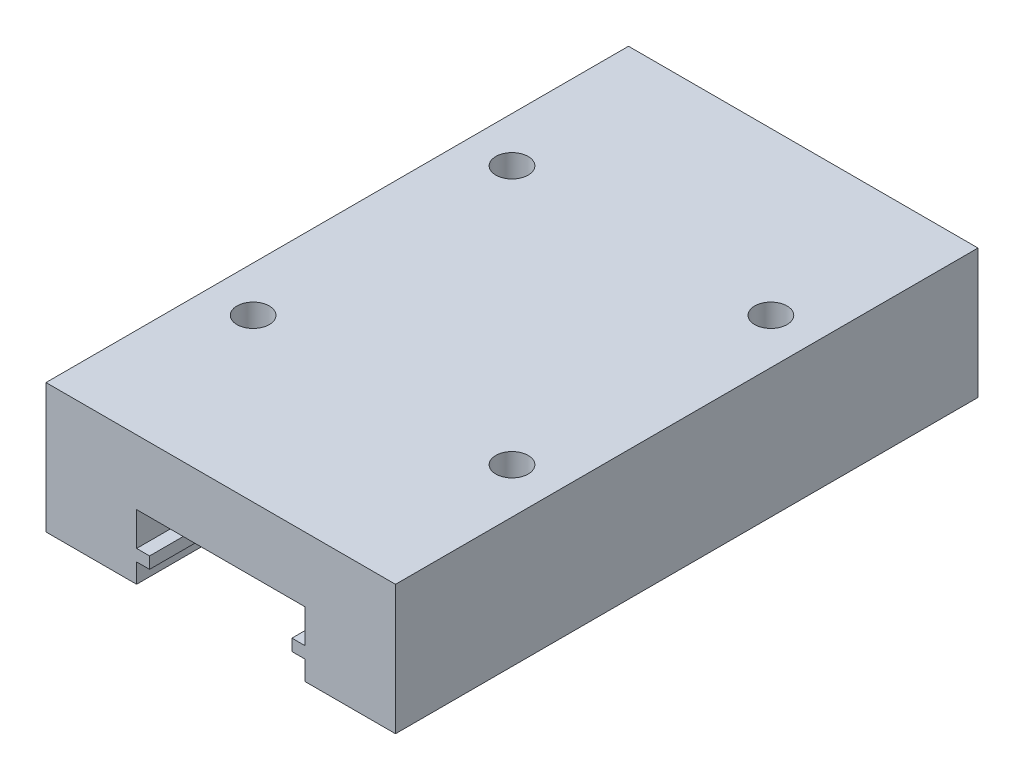
ISO-10303-21;
HEADER;
FILE_DESCRIPTION(('STEP AP214'),'2;1');
FILE_NAME('part.step','',(''),(''),'','','');
FILE_SCHEMA(('AUTOMOTIVE_DESIGN { 1 0 10303 214 1 1 1 1 }'));
ENDSEC;
DATA;
#1=APPLICATION_CONTEXT('core data for automotive mechanical design processes');
#2=APPLICATION_PROTOCOL_DEFINITION('international standard','automotive_design',2000,#1);
#3=PRODUCT_CONTEXT('',#1,'mechanical');
#4=PRODUCT('Part','Part','',(#3));
#5=PRODUCT_RELATED_PRODUCT_CATEGORY('part','',(#4));
#6=PRODUCT_DEFINITION_FORMATION('','',#4);
#7=PRODUCT_DEFINITION_CONTEXT('part definition',#1,'design');
#8=PRODUCT_DEFINITION('design','',#6,#7);
#9=PRODUCT_DEFINITION_SHAPE('','',#8);
#10=(LENGTH_UNIT() NAMED_UNIT(*) SI_UNIT(.MILLI.,.METRE.));
#11=(NAMED_UNIT(*) PLANE_ANGLE_UNIT() SI_UNIT($,.RADIAN.));
#12=(NAMED_UNIT(*) SI_UNIT($,.STERADIAN.) SOLID_ANGLE_UNIT());
#13=UNCERTAINTY_MEASURE_WITH_UNIT(LENGTH_MEASURE(1.E-05),#10,'distance_accuracy_value','');
#14=(GEOMETRIC_REPRESENTATION_CONTEXT(3) GLOBAL_UNCERTAINTY_ASSIGNED_CONTEXT((#13)) GLOBAL_UNIT_ASSIGNED_CONTEXT((#10,
#11,#12)) REPRESENTATION_CONTEXT('',''));
#15=CARTESIAN_POINT('',(0.,0.,0.));
#16=DIRECTION('',(0.,0.,1.));
#17=DIRECTION('',(1.,0.,0.));
#18=AXIS2_PLACEMENT_3D('',#15,#16,#17);
#19=CARTESIAN_POINT('',(13.5,-5.,22.5));
#20=DIRECTION('',(-1.,0.,0.));
#21=DIRECTION('',(0.,0.,1.));
#22=AXIS2_PLACEMENT_3D('',#19,#20,#21);
#23=PLANE('',#22);
#24=DIRECTION('',(0.,1.,0.));
#25=VECTOR('',#24,1.);
#26=CARTESIAN_POINT('',(13.5,-5.,-22.5));
#27=LINE('',#26,#25);
#28=CARTESIAN_POINT('',(13.5,-5.,-22.5));
#29=VERTEX_POINT('',#28);
#30=CARTESIAN_POINT('',(13.5,5.,-22.5));
#31=VERTEX_POINT('',#30);
#32=EDGE_CURVE('E199',#29,#31,#27,.T.);
#33=ORIENTED_EDGE('',*,*,#32,.T.);
#34=DIRECTION('',(0.,0.,-1.));
#35=VECTOR('',#34,1.);
#36=CARTESIAN_POINT('',(13.5,5.,22.5));
#37=LINE('',#36,#35);
#38=CARTESIAN_POINT('',(13.5,5.,22.5));
#39=VERTEX_POINT('',#38);
#40=EDGE_CURVE('E11',#39,#31,#37,.T.);
#41=ORIENTED_EDGE('',*,*,#40,.F.);
#42=DIRECTION('',(0.,1.,0.));
#43=VECTOR('',#42,1.);
#44=CARTESIAN_POINT('',(13.5,-5.,22.5));
#45=LINE('',#44,#43);
#46=CARTESIAN_POINT('',(13.5,-5.,22.5));
#47=VERTEX_POINT('',#46);
#48=EDGE_CURVE('E246',#47,#39,#45,.T.);
#49=ORIENTED_EDGE('',*,*,#48,.F.);
#50=DIRECTION('',(0.,0.,-1.));
#51=VECTOR('',#50,1.);
#52=CARTESIAN_POINT('',(13.5,-5.,22.5));
#53=LINE('',#52,#51);
#54=EDGE_CURVE('E195',#47,#29,#53,.T.);
#55=ORIENTED_EDGE('',*,*,#54,.T.);
#56=EDGE_LOOP('',(#33,#41,#49,#55));
#57=FACE_BOUND('',#56,.T.);
#58=ADVANCED_FACE('F47',(#57),#23,.F.);
#59=CARTESIAN_POINT('',(-13.5,5.,22.5));
#60=DIRECTION('',(0.,-1.,0.));
#61=DIRECTION('',(0.,0.,-1.));
#62=AXIS2_PLACEMENT_3D('',#59,#60,#61);
#63=PLANE('',#62);
#64=CARTESIAN_POINT('',(-10.,5.,-10.));
#65=DIRECTION('',(0.,1.,0.));
#66=DIRECTION('',(0.,0.,1.));
#67=AXIS2_PLACEMENT_3D('',#64,#65,#66);
#68=CIRCLE('',#67,1.25);
#69=CARTESIAN_POINT('',(-10.,5.,-8.75));
#70=VERTEX_POINT('',#69);
#71=EDGE_CURVE('E653',#70,#70,#68,.T.);
#72=ORIENTED_EDGE('',*,*,#71,.F.);
#73=EDGE_LOOP('',(#72));
#74=FACE_BOUND('',#73,.T.);
#75=CARTESIAN_POINT('',(-10.,5.,10.));
#76=DIRECTION('',(0.,1.,0.));
#77=DIRECTION('',(0.,0.,1.));
#78=AXIS2_PLACEMENT_3D('',#75,#76,#77);
#79=CIRCLE('',#78,1.25);
#80=CARTESIAN_POINT('',(-10.,5.,11.25));
#81=VERTEX_POINT('',#80);
#82=EDGE_CURVE('E657',#81,#81,#79,.T.);
#83=ORIENTED_EDGE('',*,*,#82,.F.);
#84=EDGE_LOOP('',(#83));
#85=FACE_BOUND('',#84,.T.);
#86=CARTESIAN_POINT('',(10.,5.,10.));
#87=DIRECTION('',(0.,1.,0.));
#88=DIRECTION('',(0.,0.,1.));
#89=AXIS2_PLACEMENT_3D('',#86,#87,#88);
#90=CIRCLE('',#89,1.25);
#91=CARTESIAN_POINT('',(10.,5.,11.25));
#92=VERTEX_POINT('',#91);
#93=EDGE_CURVE('E667',#92,#92,#90,.T.);
#94=ORIENTED_EDGE('',*,*,#93,.F.);
#95=EDGE_LOOP('',(#94));
#96=FACE_BOUND('',#95,.T.);
#97=CARTESIAN_POINT('',(10.,5.,-10.));
#98=DIRECTION('',(0.,1.,0.));
#99=DIRECTION('',(0.,0.,1.));
#100=AXIS2_PLACEMENT_3D('',#97,#98,#99);
#101=CIRCLE('',#100,1.25);
#102=CARTESIAN_POINT('',(10.,5.,-8.75));
#103=VERTEX_POINT('',#102);
#104=EDGE_CURVE('E675',#103,#103,#101,.T.);
#105=ORIENTED_EDGE('',*,*,#104,.F.);
#106=EDGE_LOOP('',(#105));
#107=FACE_BOUND('',#106,.T.);
#108=DIRECTION('',(-1.,0.,0.));
#109=VECTOR('',#108,1.);
#110=CARTESIAN_POINT('',(-13.5,5.,-22.5));
#111=LINE('',#110,#109);
#112=CARTESIAN_POINT('',(-13.5,5.,-22.5));
#113=VERTEX_POINT('',#112);
#114=EDGE_CURVE('E203',#31,#113,#111,.T.);
#115=ORIENTED_EDGE('',*,*,#114,.T.);
#116=DIRECTION('',(0.,0.,-1.));
#117=VECTOR('',#116,1.);
#118=CARTESIAN_POINT('',(-13.5,5.,22.5));
#119=LINE('',#118,#117);
#120=CARTESIAN_POINT('',(-13.5,5.,22.5));
#121=VERTEX_POINT('',#120);
#122=EDGE_CURVE('E56',#121,#113,#119,.T.);
#123=ORIENTED_EDGE('',*,*,#122,.F.);
#124=DIRECTION('',(-1.,0.,0.));
#125=VECTOR('',#124,1.);
#126=CARTESIAN_POINT('',(-13.5,5.,22.5));
#127=LINE('',#126,#125);
#128=EDGE_CURVE('E132',#39,#121,#127,.T.);
#129=ORIENTED_EDGE('',*,*,#128,.F.);
#130=ORIENTED_EDGE('',*,*,#40,.T.);
#131=EDGE_LOOP('',(#115,#123,#129,#130));
#132=FACE_BOUND('',#131,.T.);
#133=ADVANCED_FACE('F368',(#74,#85,#96,#107,#132),#63,.F.);
#134=CARTESIAN_POINT('',(-13.5,-5.,22.5));
#135=DIRECTION('',(1.,0.,0.));
#136=DIRECTION('',(0.,0.,-1.));
#137=AXIS2_PLACEMENT_3D('',#134,#135,#136);
#138=PLANE('',#137);
#139=DIRECTION('',(0.,-1.,0.));
#140=VECTOR('',#139,1.);
#141=CARTESIAN_POINT('',(-13.5,-5.,-22.5));
#142=LINE('',#141,#140);
#143=CARTESIAN_POINT('',(-13.5,-5.,-22.5));
#144=VERTEX_POINT('',#143);
#145=EDGE_CURVE('E207',#113,#144,#142,.T.);
#146=ORIENTED_EDGE('',*,*,#145,.T.);
#147=DIRECTION('',(0.,0.,-1.));
#148=VECTOR('',#147,1.);
#149=CARTESIAN_POINT('',(-13.5,-5.,22.5));
#150=LINE('',#149,#148);
#151=CARTESIAN_POINT('',(-13.5,-5.,22.5));
#152=VERTEX_POINT('',#151);
#153=EDGE_CURVE('E289',#152,#144,#150,.T.);
#154=ORIENTED_EDGE('',*,*,#153,.F.);
#155=DIRECTION('',(0.,-1.,0.));
#156=VECTOR('',#155,1.);
#157=CARTESIAN_POINT('',(-13.5,-5.,22.5));
#158=LINE('',#157,#156);
#159=EDGE_CURVE('E299',#121,#152,#158,.T.);
#160=ORIENTED_EDGE('',*,*,#159,.F.);
#161=ORIENTED_EDGE('',*,*,#122,.T.);
#162=EDGE_LOOP('',(#146,#154,#160,#161));
#163=FACE_BOUND('',#162,.T.);
#164=ADVANCED_FACE('F297',(#163),#138,.F.);
#165=CARTESIAN_POINT('',(-13.5,-5.,22.5));
#166=DIRECTION('',(0.,1.,0.));
#167=DIRECTION('',(0.,0.,1.));
#168=AXIS2_PLACEMENT_3D('',#165,#166,#167);
#169=PLANE('',#168);
#170=DIRECTION('',(1.,0.,0.));
#171=VECTOR('',#170,1.);
#172=CARTESIAN_POINT('',(-13.5,-5.,-22.5));
#173=LINE('',#172,#171);
#174=CARTESIAN_POINT('',(-6.5,-5.,-22.5));
#175=VERTEX_POINT('',#174);
#176=EDGE_CURVE('E210',#144,#175,#173,.T.);
#177=ORIENTED_EDGE('',*,*,#176,.T.);
#178=DIRECTION('',(0.,0.,-1.));
#179=VECTOR('',#178,1.);
#180=CARTESIAN_POINT('',(-6.5,-5.,22.5));
#181=LINE('',#180,#179);
#182=CARTESIAN_POINT('',(-6.5,-5.,22.5));
#183=VERTEX_POINT('',#182);
#184=EDGE_CURVE('E285',#183,#175,#181,.T.);
#185=ORIENTED_EDGE('',*,*,#184,.F.);
#186=DIRECTION('',(1.,0.,0.));
#187=VECTOR('',#186,1.);
#188=CARTESIAN_POINT('',(-13.5,-5.,22.5));
#189=LINE('',#188,#187);
#190=EDGE_CURVE('E318',#152,#183,#189,.T.);
#191=ORIENTED_EDGE('',*,*,#190,.F.);
#192=ORIENTED_EDGE('',*,*,#153,.T.);
#193=EDGE_LOOP('',(#177,#185,#191,#192));
#194=FACE_BOUND('',#193,.T.);
#195=ADVANCED_FACE('F308',(#194),#169,.F.);
#196=CARTESIAN_POINT('',(-6.5,-5.,22.5));
#197=DIRECTION('',(-1.,0.,0.));
#198=DIRECTION('',(0.,0.,1.));
#199=AXIS2_PLACEMENT_3D('',#196,#197,#198);
#200=PLANE('',#199);
#201=DIRECTION('',(0.,1.,0.));
#202=VECTOR('',#201,1.);
#203=CARTESIAN_POINT('',(-6.5,-5.,-22.5));
#204=LINE('',#203,#202);
#205=CARTESIAN_POINT('',(-6.5,-3.5,-22.5));
#206=VERTEX_POINT('',#205);
#207=EDGE_CURVE('E213',#175,#206,#204,.T.);
#208=ORIENTED_EDGE('',*,*,#207,.T.);
#209=DIRECTION('',(0.,0.,-1.));
#210=VECTOR('',#209,1.);
#211=CARTESIAN_POINT('',(-6.5,-3.5,22.5));
#212=LINE('',#211,#210);
#213=CARTESIAN_POINT('',(-6.5,-3.5,22.5));
#214=VERTEX_POINT('',#213);
#215=EDGE_CURVE('E281',#214,#206,#212,.T.);
#216=ORIENTED_EDGE('',*,*,#215,.F.);
#217=DIRECTION('',(0.,1.,0.));
#218=VECTOR('',#217,1.);
#219=CARTESIAN_POINT('',(-6.5,-5.,22.5));
#220=LINE('',#219,#218);
#221=EDGE_CURVE('E314',#183,#214,#220,.T.);
#222=ORIENTED_EDGE('',*,*,#221,.F.);
#223=ORIENTED_EDGE('',*,*,#184,.T.);
#224=EDGE_LOOP('',(#208,#216,#222,#223));
#225=FACE_BOUND('',#224,.T.);
#226=ADVANCED_FACE('F312',(#225),#200,.F.);
#227=CARTESIAN_POINT('',(-6.5,-3.5,22.5));
#228=DIRECTION('',(0.,1.,0.));
#229=DIRECTION('',(-1.,0.,0.));
#230=AXIS2_PLACEMENT_3D('',#227,#228,#229);
#231=PLANE('',#230);
#232=DIRECTION('',(1.,0.,0.));
#233=VECTOR('',#232,1.);
#234=CARTESIAN_POINT('',(-6.5,-3.5,-22.5));
#235=LINE('',#234,#233);
#236=CARTESIAN_POINT('',(-5.5,-3.5,-22.5));
#237=VERTEX_POINT('',#236);
#238=EDGE_CURVE('E216',#206,#237,#235,.T.);
#239=ORIENTED_EDGE('',*,*,#238,.T.);
#240=DIRECTION('',(0.,0.,-1.));
#241=VECTOR('',#240,1.);
#242=CARTESIAN_POINT('',(-5.5,-3.5,22.5));
#243=LINE('',#242,#241);
#244=CARTESIAN_POINT('',(-5.5,-3.5,22.5));
#245=VERTEX_POINT('',#244);
#246=EDGE_CURVE('E277',#245,#237,#243,.T.);
#247=ORIENTED_EDGE('',*,*,#246,.F.);
#248=DIRECTION('',(1.,0.,0.));
#249=VECTOR('',#248,1.);
#250=CARTESIAN_POINT('',(-6.5,-3.5,22.5));
#251=LINE('',#250,#249);
#252=EDGE_CURVE('E317',#214,#245,#251,.T.);
#253=ORIENTED_EDGE('',*,*,#252,.F.);
#254=ORIENTED_EDGE('',*,*,#215,.T.);
#255=EDGE_LOOP('',(#239,#247,#253,#254));
#256=FACE_BOUND('',#255,.T.);
#257=ADVANCED_FACE('F384',(#256),#231,.F.);
#258=CARTESIAN_POINT('',(-5.5,-2.6,22.5));
#259=DIRECTION('',(-1.,0.,0.));
#260=DIRECTION('',(0.,0.,1.));
#261=AXIS2_PLACEMENT_3D('',#258,#259,#260);
#262=PLANE('',#261);
#263=DIRECTION('',(0.,1.,0.));
#264=VECTOR('',#263,1.);
#265=CARTESIAN_POINT('',(-5.5,-2.6,-22.5));
#266=LINE('',#265,#264);
#267=CARTESIAN_POINT('',(-5.5,-2.6,-22.5));
#268=VERTEX_POINT('',#267);
#269=EDGE_CURVE('E219',#237,#268,#266,.T.);
#270=ORIENTED_EDGE('',*,*,#269,.T.);
#271=DIRECTION('',(0.,0.,-1.));
#272=VECTOR('',#271,1.);
#273=CARTESIAN_POINT('',(-5.5,-2.6,22.5));
#274=LINE('',#273,#272);
#275=CARTESIAN_POINT('',(-5.5,-2.6,22.5));
#276=VERTEX_POINT('',#275);
#277=EDGE_CURVE('E273',#276,#268,#274,.T.);
#278=ORIENTED_EDGE('',*,*,#277,.F.);
#279=DIRECTION('',(0.,1.,0.));
#280=VECTOR('',#279,1.);
#281=CARTESIAN_POINT('',(-5.5,-2.6,22.5));
#282=LINE('',#281,#280);
#283=EDGE_CURVE('E322',#245,#276,#282,.T.);
#284=ORIENTED_EDGE('',*,*,#283,.F.);
#285=ORIENTED_EDGE('',*,*,#246,.T.);
#286=EDGE_LOOP('',(#270,#278,#284,#285));
#287=FACE_BOUND('',#286,.T.);
#288=ADVANCED_FACE('F387',(#287),#262,.F.);
#289=CARTESIAN_POINT('',(-6.5,-2.6,22.5));
#290=DIRECTION('',(0.,-1.,0.));
#291=DIRECTION('',(1.,0.,0.));
#292=AXIS2_PLACEMENT_3D('',#289,#290,#291);
#293=PLANE('',#292);
#294=DIRECTION('',(-1.,0.,0.));
#295=VECTOR('',#294,1.);
#296=CARTESIAN_POINT('',(-6.5,-2.6,-22.5));
#297=LINE('',#296,#295);
#298=CARTESIAN_POINT('',(-6.5,-2.6,-22.5));
#299=VERTEX_POINT('',#298);
#300=EDGE_CURVE('E222',#268,#299,#297,.T.);
#301=ORIENTED_EDGE('',*,*,#300,.T.);
#302=DIRECTION('',(0.,0.,-1.));
#303=VECTOR('',#302,1.);
#304=CARTESIAN_POINT('',(-6.5,-2.6,22.5));
#305=LINE('',#304,#303);
#306=CARTESIAN_POINT('',(-6.5,-2.6,22.5));
#307=VERTEX_POINT('',#306);
#308=EDGE_CURVE('E269',#307,#299,#305,.T.);
#309=ORIENTED_EDGE('',*,*,#308,.F.);
#310=DIRECTION('',(-1.,0.,0.));
#311=VECTOR('',#310,1.);
#312=CARTESIAN_POINT('',(-6.5,-2.6,22.5));
#313=LINE('',#312,#311);
#314=EDGE_CURVE('E329',#276,#307,#313,.T.);
#315=ORIENTED_EDGE('',*,*,#314,.F.);
#316=ORIENTED_EDGE('',*,*,#277,.T.);
#317=EDGE_LOOP('',(#301,#309,#315,#316));
#318=FACE_BOUND('',#317,.T.);
#319=ADVANCED_FACE('F391',(#318),#293,.F.);
#320=CARTESIAN_POINT('',(-6.5,-2.6,22.5));
#321=DIRECTION('',(-1.,0.,0.));
#322=DIRECTION('',(0.,0.,1.));
#323=AXIS2_PLACEMENT_3D('',#320,#321,#322);
#324=PLANE('',#323);
#325=DIRECTION('',(0.,1.,0.));
#326=VECTOR('',#325,1.);
#327=CARTESIAN_POINT('',(-6.5,-2.6,-22.5));
#328=LINE('',#327,#326);
#329=CARTESIAN_POINT('',(-6.5,0.,-22.5));
#330=VERTEX_POINT('',#329);
#331=EDGE_CURVE('E225',#299,#330,#328,.T.);
#332=ORIENTED_EDGE('',*,*,#331,.T.);
#333=DIRECTION('',(0.,0.,-1.));
#334=VECTOR('',#333,1.);
#335=CARTESIAN_POINT('',(-6.5,0.,22.5));
#336=LINE('',#335,#334);
#337=CARTESIAN_POINT('',(-6.5,0.,22.5));
#338=VERTEX_POINT('',#337);
#339=EDGE_CURVE('E265',#338,#330,#336,.T.);
#340=ORIENTED_EDGE('',*,*,#339,.F.);
#341=DIRECTION('',(0.,1.,0.));
#342=VECTOR('',#341,1.);
#343=CARTESIAN_POINT('',(-6.5,-2.6,22.5));
#344=LINE('',#343,#342);
#345=EDGE_CURVE('E332',#307,#338,#344,.T.);
#346=ORIENTED_EDGE('',*,*,#345,.F.);
#347=ORIENTED_EDGE('',*,*,#308,.T.);
#348=EDGE_LOOP('',(#332,#340,#346,#347));
#349=FACE_BOUND('',#348,.T.);
#350=ADVANCED_FACE('F395',(#349),#324,.F.);
#351=CARTESIAN_POINT('',(-6.5,0.,22.5));
#352=DIRECTION('',(0.,1.,0.));
#353=DIRECTION('',(0.,0.,1.));
#354=AXIS2_PLACEMENT_3D('',#351,#352,#353);
#355=PLANE('',#354);
#356=DIRECTION('',(1.,0.,0.));
#357=VECTOR('',#356,1.);
#358=CARTESIAN_POINT('',(-6.5,0.,-22.5));
#359=LINE('',#358,#357);
#360=CARTESIAN_POINT('',(6.5,0.,-22.5));
#361=VERTEX_POINT('',#360);
#362=EDGE_CURVE('E228',#330,#361,#359,.T.);
#363=ORIENTED_EDGE('',*,*,#362,.T.);
#364=DIRECTION('',(0.,0.,-1.));
#365=VECTOR('',#364,1.);
#366=CARTESIAN_POINT('',(6.5,0.,22.5));
#367=LINE('',#366,#365);
#368=CARTESIAN_POINT('',(6.5,0.,22.5));
#369=VERTEX_POINT('',#368);
#370=EDGE_CURVE('E261',#369,#361,#367,.T.);
#371=ORIENTED_EDGE('',*,*,#370,.F.);
#372=DIRECTION('',(1.,0.,0.));
#373=VECTOR('',#372,1.);
#374=CARTESIAN_POINT('',(-6.5,0.,22.5));
#375=LINE('',#374,#373);
#376=EDGE_CURVE('E335',#338,#369,#375,.T.);
#377=ORIENTED_EDGE('',*,*,#376,.F.);
#378=ORIENTED_EDGE('',*,*,#339,.T.);
#379=EDGE_LOOP('',(#363,#371,#377,#378));
#380=FACE_BOUND('',#379,.T.);
#381=ADVANCED_FACE('F399',(#380),#355,.F.);
#382=CARTESIAN_POINT('',(6.5,-2.6,22.5));
#383=DIRECTION('',(1.,0.,0.));
#384=DIRECTION('',(0.,1.,0.));
#385=AXIS2_PLACEMENT_3D('',#382,#383,#384);
#386=PLANE('',#385);
#387=DIRECTION('',(0.,-1.,0.));
#388=VECTOR('',#387,1.);
#389=CARTESIAN_POINT('',(6.5,-2.6,-22.5));
#390=LINE('',#389,#388);
#391=CARTESIAN_POINT('',(6.5,-2.6,-22.5));
#392=VERTEX_POINT('',#391);
#393=EDGE_CURVE('E231',#361,#392,#390,.T.);
#394=ORIENTED_EDGE('',*,*,#393,.T.);
#395=DIRECTION('',(0.,0.,-1.));
#396=VECTOR('',#395,1.);
#397=CARTESIAN_POINT('',(6.5,-2.6,22.5));
#398=LINE('',#397,#396);
#399=CARTESIAN_POINT('',(6.5,-2.6,22.5));
#400=VERTEX_POINT('',#399);
#401=EDGE_CURVE('E257',#400,#392,#398,.T.);
#402=ORIENTED_EDGE('',*,*,#401,.F.);
#403=DIRECTION('',(0.,-1.,0.));
#404=VECTOR('',#403,1.);
#405=CARTESIAN_POINT('',(6.5,-2.6,22.5));
#406=LINE('',#405,#404);
#407=EDGE_CURVE('E338',#369,#400,#406,.T.);
#408=ORIENTED_EDGE('',*,*,#407,.F.);
#409=ORIENTED_EDGE('',*,*,#370,.T.);
#410=EDGE_LOOP('',(#394,#402,#408,#409));
#411=FACE_BOUND('',#410,.T.);
#412=ADVANCED_FACE('F403',(#411),#386,.F.);
#413=CARTESIAN_POINT('',(6.5,-2.6,22.5));
#414=DIRECTION('',(0.,-1.,0.));
#415=DIRECTION('',(1.,0.,0.));
#416=AXIS2_PLACEMENT_3D('',#413,#414,#415);
#417=PLANE('',#416);
#418=DIRECTION('',(-1.,0.,0.));
#419=VECTOR('',#418,1.);
#420=CARTESIAN_POINT('',(6.5,-2.6,-22.5));
#421=LINE('',#420,#419);
#422=CARTESIAN_POINT('',(5.5,-2.6,-22.5));
#423=VERTEX_POINT('',#422);
#424=EDGE_CURVE('E234',#392,#423,#421,.T.);
#425=ORIENTED_EDGE('',*,*,#424,.T.);
#426=DIRECTION('',(0.,0.,-1.));
#427=VECTOR('',#426,1.);
#428=CARTESIAN_POINT('',(5.5,-2.6,22.5));
#429=LINE('',#428,#427);
#430=CARTESIAN_POINT('',(5.5,-2.6,22.5));
#431=VERTEX_POINT('',#430);
#432=EDGE_CURVE('E253',#431,#423,#429,.T.);
#433=ORIENTED_EDGE('',*,*,#432,.F.);
#434=DIRECTION('',(-1.,0.,0.));
#435=VECTOR('',#434,1.);
#436=CARTESIAN_POINT('',(6.5,-2.6,22.5));
#437=LINE('',#436,#435);
#438=EDGE_CURVE('E341',#400,#431,#437,.T.);
#439=ORIENTED_EDGE('',*,*,#438,.F.);
#440=ORIENTED_EDGE('',*,*,#401,.T.);
#441=EDGE_LOOP('',(#425,#433,#439,#440));
#442=FACE_BOUND('',#441,.T.);
#443=ADVANCED_FACE('F349',(#442),#417,.F.);
#444=CARTESIAN_POINT('',(5.5,-2.6,22.5));
#445=DIRECTION('',(1.,0.,0.));
#446=DIRECTION('',(0.,0.,-1.));
#447=AXIS2_PLACEMENT_3D('',#444,#445,#446);
#448=PLANE('',#447);
#449=DIRECTION('',(0.,-1.,0.));
#450=VECTOR('',#449,1.);
#451=CARTESIAN_POINT('',(5.5,-2.6,-22.5));
#452=LINE('',#451,#450);
#453=CARTESIAN_POINT('',(5.5,-3.5,-22.5));
#454=VERTEX_POINT('',#453);
#455=EDGE_CURVE('E237',#423,#454,#452,.T.);
#456=ORIENTED_EDGE('',*,*,#455,.T.);
#457=DIRECTION('',(0.,0.,-1.));
#458=VECTOR('',#457,1.);
#459=CARTESIAN_POINT('',(5.5,-3.5,22.5));
#460=LINE('',#459,#458);
#461=CARTESIAN_POINT('',(5.5,-3.5,22.5));
#462=VERTEX_POINT('',#461);
#463=EDGE_CURVE('E188',#462,#454,#460,.T.);
#464=ORIENTED_EDGE('',*,*,#463,.F.);
#465=DIRECTION('',(0.,-1.,0.));
#466=VECTOR('',#465,1.);
#467=CARTESIAN_POINT('',(5.5,-2.6,22.5));
#468=LINE('',#467,#466);
#469=EDGE_CURVE('E177',#431,#462,#468,.T.);
#470=ORIENTED_EDGE('',*,*,#469,.F.);
#471=ORIENTED_EDGE('',*,*,#432,.T.);
#472=EDGE_LOOP('',(#456,#464,#470,#471));
#473=FACE_BOUND('',#472,.T.);
#474=ADVANCED_FACE('F353',(#473),#448,.F.);
#475=CARTESIAN_POINT('',(6.5,-3.5,22.5));
#476=DIRECTION('',(0.,1.,0.));
#477=DIRECTION('',(-1.,0.,0.));
#478=AXIS2_PLACEMENT_3D('',#475,#476,#477);
#479=PLANE('',#478);
#480=DIRECTION('',(1.,0.,0.));
#481=VECTOR('',#480,1.);
#482=CARTESIAN_POINT('',(6.5,-3.5,-22.5));
#483=LINE('',#482,#481);
#484=CARTESIAN_POINT('',(6.5,-3.5,-22.5));
#485=VERTEX_POINT('',#484);
#486=EDGE_CURVE('E186',#454,#485,#483,.T.);
#487=ORIENTED_EDGE('',*,*,#486,.T.);
#488=DIRECTION('',(0.,0.,-1.));
#489=VECTOR('',#488,1.);
#490=CARTESIAN_POINT('',(6.5,-3.5,22.5));
#491=LINE('',#490,#489);
#492=CARTESIAN_POINT('',(6.5,-3.5,22.5));
#493=VERTEX_POINT('',#492);
#494=EDGE_CURVE('E183',#493,#485,#491,.T.);
#495=ORIENTED_EDGE('',*,*,#494,.F.);
#496=DIRECTION('',(1.,0.,0.));
#497=VECTOR('',#496,1.);
#498=CARTESIAN_POINT('',(6.5,-3.5,22.5));
#499=LINE('',#498,#497);
#500=EDGE_CURVE('E171',#462,#493,#499,.T.);
#501=ORIENTED_EDGE('',*,*,#500,.F.);
#502=ORIENTED_EDGE('',*,*,#463,.T.);
#503=EDGE_LOOP('',(#487,#495,#501,#502));
#504=FACE_BOUND('',#503,.T.);
#505=ADVANCED_FACE('F184',(#504),#479,.F.);
#506=CARTESIAN_POINT('',(6.5,-5.,22.5));
#507=DIRECTION('',(1.,0.,0.));
#508=DIRECTION('',(0.,1.,0.));
#509=AXIS2_PLACEMENT_3D('',#506,#507,#508);
#510=PLANE('',#509);
#511=DIRECTION('',(0.,-1.,0.));
#512=VECTOR('',#511,1.);
#513=CARTESIAN_POINT('',(6.5,-5.,-22.5));
#514=LINE('',#513,#512);
#515=CARTESIAN_POINT('',(6.5,-5.,-22.5));
#516=VERTEX_POINT('',#515);
#517=EDGE_CURVE('E118',#485,#516,#514,.T.);
#518=ORIENTED_EDGE('',*,*,#517,.T.);
#519=DIRECTION('',(0.,0.,-1.));
#520=VECTOR('',#519,1.);
#521=CARTESIAN_POINT('',(6.5,-5.,22.5));
#522=LINE('',#521,#520);
#523=CARTESIAN_POINT('',(6.5,-5.,22.5));
#524=VERTEX_POINT('',#523);
#525=EDGE_CURVE('E189',#524,#516,#522,.T.);
#526=ORIENTED_EDGE('',*,*,#525,.F.);
#527=DIRECTION('',(0.,-1.,0.));
#528=VECTOR('',#527,1.);
#529=CARTESIAN_POINT('',(6.5,-5.,22.5));
#530=LINE('',#529,#528);
#531=EDGE_CURVE('E175',#493,#524,#530,.T.);
#532=ORIENTED_EDGE('',*,*,#531,.F.);
#533=ORIENTED_EDGE('',*,*,#494,.T.);
#534=EDGE_LOOP('',(#518,#526,#532,#533));
#535=FACE_BOUND('',#534,.T.);
#536=ADVANCED_FACE('F191',(#535),#510,.F.);
#537=CARTESIAN_POINT('',(6.5,-5.,22.5));
#538=DIRECTION('',(0.,1.,0.));
#539=DIRECTION('',(-1.,0.,0.));
#540=AXIS2_PLACEMENT_3D('',#537,#538,#539);
#541=PLANE('',#540);
#542=DIRECTION('',(1.,0.,0.));
#543=VECTOR('',#542,1.);
#544=CARTESIAN_POINT('',(6.5,-5.,-22.5));
#545=LINE('',#544,#543);
#546=EDGE_CURVE('E124',#516,#29,#545,.T.);
#547=ORIENTED_EDGE('',*,*,#546,.T.);
#548=ORIENTED_EDGE('',*,*,#54,.F.);
#549=DIRECTION('',(1.,0.,0.));
#550=VECTOR('',#549,1.);
#551=CARTESIAN_POINT('',(6.5,-5.,22.5));
#552=LINE('',#551,#550);
#553=EDGE_CURVE('E64',#524,#47,#552,.T.);
#554=ORIENTED_EDGE('',*,*,#553,.F.);
#555=ORIENTED_EDGE('',*,*,#525,.T.);
#556=EDGE_LOOP('',(#547,#548,#554,#555));
#557=FACE_BOUND('',#556,.T.);
#558=ADVANCED_FACE('F357',(#557),#541,.F.);
#559=CARTESIAN_POINT('',(0.,0.,22.5));
#560=DIRECTION('',(0.,0.,-1.));
#561=DIRECTION('',(-1.,0.,0.));
#562=AXIS2_PLACEMENT_3D('',#559,#560,#561);
#563=PLANE('',#562);
#564=ORIENTED_EDGE('',*,*,#48,.T.);
#565=ORIENTED_EDGE('',*,*,#128,.T.);
#566=ORIENTED_EDGE('',*,*,#159,.T.);
#567=ORIENTED_EDGE('',*,*,#190,.T.);
#568=ORIENTED_EDGE('',*,*,#221,.T.);
#569=ORIENTED_EDGE('',*,*,#252,.T.);
#570=ORIENTED_EDGE('',*,*,#283,.T.);
#571=ORIENTED_EDGE('',*,*,#314,.T.);
#572=ORIENTED_EDGE('',*,*,#345,.T.);
#573=ORIENTED_EDGE('',*,*,#376,.T.);
#574=ORIENTED_EDGE('',*,*,#407,.T.);
#575=ORIENTED_EDGE('',*,*,#438,.T.);
#576=ORIENTED_EDGE('',*,*,#469,.T.);
#577=ORIENTED_EDGE('',*,*,#500,.T.);
#578=ORIENTED_EDGE('',*,*,#531,.T.);
#579=ORIENTED_EDGE('',*,*,#553,.T.);
#580=EDGE_LOOP('',(#564,#565,#566,#567,#568,#569,#570,#571,#572,#573,#574,#575,#576,#577,#578,#579));
#581=FACE_BOUND('',#580,.T.);
#582=ADVANCED_FACE('F173',(#581),#563,.F.);
#583=CARTESIAN_POINT('',(0.,0.,-22.5));
#584=DIRECTION('',(0.,0.,-1.));
#585=DIRECTION('',(-1.,0.,0.));
#586=AXIS2_PLACEMENT_3D('',#583,#584,#585);
#587=PLANE('',#586);
#588=ORIENTED_EDGE('',*,*,#32,.F.);
#589=ORIENTED_EDGE('',*,*,#546,.F.);
#590=ORIENTED_EDGE('',*,*,#517,.F.);
#591=ORIENTED_EDGE('',*,*,#486,.F.);
#592=ORIENTED_EDGE('',*,*,#455,.F.);
#593=ORIENTED_EDGE('',*,*,#424,.F.);
#594=ORIENTED_EDGE('',*,*,#393,.F.);
#595=ORIENTED_EDGE('',*,*,#362,.F.);
#596=ORIENTED_EDGE('',*,*,#331,.F.);
#597=ORIENTED_EDGE('',*,*,#300,.F.);
#598=ORIENTED_EDGE('',*,*,#269,.F.);
#599=ORIENTED_EDGE('',*,*,#238,.F.);
#600=ORIENTED_EDGE('',*,*,#207,.F.);
#601=ORIENTED_EDGE('',*,*,#176,.F.);
#602=ORIENTED_EDGE('',*,*,#145,.F.);
#603=ORIENTED_EDGE('',*,*,#114,.F.);
#604=EDGE_LOOP('',(#588,#589,#590,#591,#592,#593,#594,#595,#596,#597,#598,#599,#600,#601,#602,#603));
#605=FACE_BOUND('',#604,.T.);
#606=ADVANCED_FACE('F303',(#605),#587,.T.);
#607=CARTESIAN_POINT('',(10.,0.,-10.));
#608=DIRECTION('',(0.,1.,0.));
#609=DIRECTION('',(0.,0.,1.));
#610=AXIS2_PLACEMENT_3D('',#607,#608,#609);
#611=CONICAL_SURFACE('',#610,1.25,1.02974425867665);
#612=CARTESIAN_POINT('',(9.99999999999999,-0.75107577378445,-10.));
#613=VERTEX_POINT('',#612);
#614=VERTEX_LOOP('',#613);
#615=FACE_BOUND('',#614,.T.);
#616=CARTESIAN_POINT('',(10.,0.,-10.));
#617=DIRECTION('',(0.,1.,0.));
#618=DIRECTION('',(0.,0.,1.));
#619=AXIS2_PLACEMENT_3D('',#616,#617,#618);
#620=CIRCLE('',#619,1.25);
#621=CARTESIAN_POINT('',(10.,0.,-8.75));
#622=VERTEX_POINT('',#621);
#623=EDGE_CURVE('E204',#622,#622,#620,.T.);
#624=ORIENTED_EDGE('',*,*,#623,.T.);
#625=EDGE_LOOP('',(#624));
#626=FACE_BOUND('',#625,.T.);
#627=ADVANCED_FACE('F442',(#615,#626),#611,.F.);
#628=CARTESIAN_POINT('',(10.,5.,-10.));
#629=DIRECTION('',(0.,1.,0.));
#630=DIRECTION('',(0.,0.,1.));
#631=AXIS2_PLACEMENT_3D('',#628,#629,#630);
#632=CYLINDRICAL_SURFACE('',#631,1.25);
#633=ORIENTED_EDGE('',*,*,#623,.F.);
#634=EDGE_LOOP('',(#633));
#635=FACE_BOUND('',#634,.T.);
#636=ORIENTED_EDGE('',*,*,#104,.T.);
#637=EDGE_LOOP('',(#636));
#638=FACE_BOUND('',#637,.T.);
#639=ADVANCED_FACE('F459',(#635,#638),#632,.F.);
#640=CARTESIAN_POINT('',(10.,0.,10.));
#641=DIRECTION('',(0.,1.,0.));
#642=DIRECTION('',(0.,0.,1.));
#643=AXIS2_PLACEMENT_3D('',#640,#641,#642);
#644=CONICAL_SURFACE('',#643,1.25,1.02974425867665);
#645=CARTESIAN_POINT('',(9.99999999999999,-0.75107577378445,10.));
#646=VERTEX_POINT('',#645);
#647=VERTEX_LOOP('',#646);
#648=FACE_BOUND('',#647,.T.);
#649=CARTESIAN_POINT('',(10.,0.,10.));
#650=DIRECTION('',(0.,1.,0.));
#651=DIRECTION('',(0.,0.,1.));
#652=AXIS2_PLACEMENT_3D('',#649,#650,#651);
#653=CIRCLE('',#652,1.25);
#654=CARTESIAN_POINT('',(10.,0.,11.25));
#655=VERTEX_POINT('',#654);
#656=EDGE_CURVE('E671',#655,#655,#653,.T.);
#657=ORIENTED_EDGE('',*,*,#656,.T.);
#658=EDGE_LOOP('',(#657));
#659=FACE_BOUND('',#658,.T.);
#660=ADVANCED_FACE('F470',(#648,#659),#644,.F.);
#661=CARTESIAN_POINT('',(10.,5.,10.));
#662=DIRECTION('',(0.,1.,0.));
#663=DIRECTION('',(0.,0.,1.));
#664=AXIS2_PLACEMENT_3D('',#661,#662,#663);
#665=CYLINDRICAL_SURFACE('',#664,1.25);
#666=ORIENTED_EDGE('',*,*,#656,.F.);
#667=EDGE_LOOP('',(#666));
#668=FACE_BOUND('',#667,.T.);
#669=ORIENTED_EDGE('',*,*,#93,.T.);
#670=EDGE_LOOP('',(#669));
#671=FACE_BOUND('',#670,.T.);
#672=ADVANCED_FACE('F481',(#668,#671),#665,.F.);
#673=CARTESIAN_POINT('',(-10.,0.,10.));
#674=DIRECTION('',(0.,1.,0.));
#675=DIRECTION('',(0.,0.,1.));
#676=AXIS2_PLACEMENT_3D('',#673,#674,#675);
#677=CONICAL_SURFACE('',#676,1.25,1.02974425867665);
#678=CARTESIAN_POINT('',(-10.,-0.75107577378445,10.));
#679=VERTEX_POINT('',#678);
#680=VERTEX_LOOP('',#679);
#681=FACE_BOUND('',#680,.T.);
#682=CARTESIAN_POINT('',(-10.,0.,10.));
#683=DIRECTION('',(0.,1.,0.));
#684=DIRECTION('',(0.,0.,1.));
#685=AXIS2_PLACEMENT_3D('',#682,#683,#684);
#686=CIRCLE('',#685,1.25);
#687=CARTESIAN_POINT('',(-10.,0.,11.25));
#688=VERTEX_POINT('',#687);
#689=EDGE_CURVE('E663',#688,#688,#686,.T.);
#690=ORIENTED_EDGE('',*,*,#689,.T.);
#691=EDGE_LOOP('',(#690));
#692=FACE_BOUND('',#691,.T.);
#693=ADVANCED_FACE('F492',(#681,#692),#677,.F.);
#694=CARTESIAN_POINT('',(-10.,5.,10.));
#695=DIRECTION('',(0.,1.,0.));
#696=DIRECTION('',(0.,0.,1.));
#697=AXIS2_PLACEMENT_3D('',#694,#695,#696);
#698=CYLINDRICAL_SURFACE('',#697,1.25);
#699=ORIENTED_EDGE('',*,*,#689,.F.);
#700=EDGE_LOOP('',(#699));
#701=FACE_BOUND('',#700,.T.);
#702=ORIENTED_EDGE('',*,*,#82,.T.);
#703=EDGE_LOOP('',(#702));
#704=FACE_BOUND('',#703,.T.);
#705=ADVANCED_FACE('F503',(#701,#704),#698,.F.);
#706=CARTESIAN_POINT('',(-10.,0.,-10.));
#707=DIRECTION('',(0.,1.,0.));
#708=DIRECTION('',(0.,0.,1.));
#709=AXIS2_PLACEMENT_3D('',#706,#707,#708);
#710=CONICAL_SURFACE('',#709,1.25,1.02974425867665);
#711=CARTESIAN_POINT('',(-10.,-0.75107577378445,-10.));
#712=VERTEX_POINT('',#711);
#713=VERTEX_LOOP('',#712);
#714=FACE_BOUND('',#713,.T.);
#715=CARTESIAN_POINT('',(-10.,0.,-10.));
#716=DIRECTION('',(0.,1.,0.));
#717=DIRECTION('',(0.,0.,1.));
#718=AXIS2_PLACEMENT_3D('',#715,#716,#717);
#719=CIRCLE('',#718,1.25);
#720=CARTESIAN_POINT('',(-10.,0.,-8.75));
#721=VERTEX_POINT('',#720);
#722=EDGE_CURVE('E651',#721,#721,#719,.T.);
#723=ORIENTED_EDGE('',*,*,#722,.T.);
#724=EDGE_LOOP('',(#723));
#725=FACE_BOUND('',#724,.T.);
#726=ADVANCED_FACE('F514',(#714,#725),#710,.F.);
#727=CARTESIAN_POINT('',(-10.,5.,-10.));
#728=DIRECTION('',(0.,1.,0.));
#729=DIRECTION('',(0.,0.,1.));
#730=AXIS2_PLACEMENT_3D('',#727,#728,#729);
#731=CYLINDRICAL_SURFACE('',#730,1.25);
#732=ORIENTED_EDGE('',*,*,#722,.F.);
#733=EDGE_LOOP('',(#732));
#734=FACE_BOUND('',#733,.T.);
#735=ORIENTED_EDGE('',*,*,#71,.T.);
#736=EDGE_LOOP('',(#735));
#737=FACE_BOUND('',#736,.T.);
#738=ADVANCED_FACE('F525',(#734,#737),#731,.F.);
#739=CLOSED_SHELL('',(#58,#133,#164,#195,#226,#257,#288,#319,#350,#381,#412,#443,#474,#505,#536,
#558,#582,#606,#627,#639,#660,#672,#693,#705,#726,#738));
#740=MANIFOLD_SOLID_BREP('B2',#739);
#741=ADVANCED_BREP_SHAPE_REPRESENTATION('',(#18,#740),#14);
#742=SHAPE_DEFINITION_REPRESENTATION(#9,#741);
ENDSEC;
END-ISO-10303-21;
